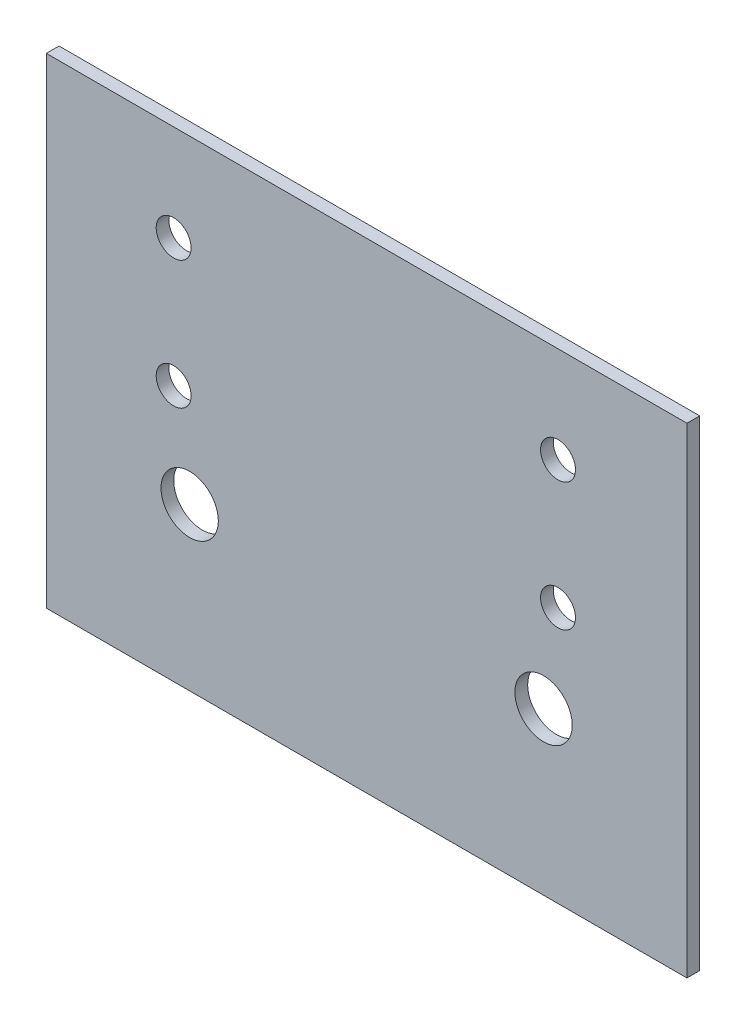
ISO-10303-21;
HEADER;
FILE_DESCRIPTION(('STEP AP214'),'2;1');
FILE_NAME('part.step','',(''),(''),'','','');
FILE_SCHEMA(('AUTOMOTIVE_DESIGN { 1 0 10303 214 1 1 1 1 }'));
ENDSEC;
DATA;
#1=APPLICATION_CONTEXT('core data for automotive mechanical design processes');
#2=APPLICATION_PROTOCOL_DEFINITION('international standard','automotive_design',2000,#1);
#3=PRODUCT_CONTEXT('',#1,'mechanical');
#4=PRODUCT('Part','Part','',(#3));
#5=PRODUCT_RELATED_PRODUCT_CATEGORY('part','',(#4));
#6=PRODUCT_DEFINITION_FORMATION('','',#4);
#7=PRODUCT_DEFINITION_CONTEXT('part definition',#1,'design');
#8=PRODUCT_DEFINITION('design','',#6,#7);
#9=PRODUCT_DEFINITION_SHAPE('','',#8);
#10=(LENGTH_UNIT() NAMED_UNIT(*) SI_UNIT(.MILLI.,.METRE.));
#11=(NAMED_UNIT(*) PLANE_ANGLE_UNIT() SI_UNIT($,.RADIAN.));
#12=(NAMED_UNIT(*) SI_UNIT($,.STERADIAN.) SOLID_ANGLE_UNIT());
#13=UNCERTAINTY_MEASURE_WITH_UNIT(LENGTH_MEASURE(1.E-05),#10,'distance_accuracy_value','');
#14=(GEOMETRIC_REPRESENTATION_CONTEXT(3) GLOBAL_UNCERTAINTY_ASSIGNED_CONTEXT((#13)) GLOBAL_UNIT_ASSIGNED_CONTEXT((#10,
#11,#12)) REPRESENTATION_CONTEXT('',''));
#15=CARTESIAN_POINT('',(0.,0.,0.));
#16=DIRECTION('',(0.,0.,1.));
#17=DIRECTION('',(1.,0.,0.));
#18=AXIS2_PLACEMENT_3D('',#15,#16,#17);
#19=CARTESIAN_POINT('',(0.,0.,8.));
#20=DIRECTION('',(0.,0.,1.));
#21=DIRECTION('',(1.,0.,0.));
#22=AXIS2_PLACEMENT_3D('',#19,#20,#21);
#23=PLANE('',#22);
#24=CARTESIAN_POINT('',(256.816671317715,-165.87972536687,8.));
#25=DIRECTION('',(0.,0.,1.));
#26=DIRECTION('',(-1.,0.,0.));
#27=AXIS2_PLACEMENT_3D('',#24,#25,#26);
#28=CIRCLE('',#27,18.);
#29=CARTESIAN_POINT('',(238.816671317715,-165.87972536687,8.));
#30=VERTEX_POINT('',#29);
#31=EDGE_CURVE('E135',#30,#30,#28,.T.);
#32=ORIENTED_EDGE('',*,*,#31,.F.);
#33=EDGE_LOOP('',(#32));
#34=FACE_BOUND('',#33,.T.);
#35=CARTESIAN_POINT('',(265.874952297419,-25.9414929111199,8.));
#36=DIRECTION('',(0.,0.,1.));
#37=DIRECTION('',(-1.,0.,0.));
#38=AXIS2_PLACEMENT_3D('',#35,#36,#37);
#39=CIRCLE('',#38,10.9608938547486);
#40=CARTESIAN_POINT('',(254.91405844267,-25.9414929111199,8.));
#41=VERTEX_POINT('',#40);
#42=EDGE_CURVE('E123',#41,#41,#39,.T.);
#43=ORIENTED_EDGE('',*,*,#42,.F.);
#44=EDGE_LOOP('',(#43));
#45=FACE_BOUND('',#44,.T.);
#46=CARTESIAN_POINT('',(24.5341701745138,-106.388420285422,8.));
#47=DIRECTION('',(0.,0.,1.));
#48=DIRECTION('',(1.,0.,0.));
#49=AXIS2_PLACEMENT_3D('',#46,#47,#48);
#50=CIRCLE('',#49,10.9608938547486);
#51=CARTESIAN_POINT('',(35.4950640292624,-106.388420285422,8.));
#52=VERTEX_POINT('',#51);
#53=EDGE_CURVE('E102',#52,#52,#50,.T.);
#54=ORIENTED_EDGE('',*,*,#53,.F.);
#55=EDGE_LOOP('',(#54));
#56=FACE_BOUND('',#55,.T.);
#57=DIRECTION('',(0.,-1.,0.));
#58=VECTOR('',#57,1.);
#59=CARTESIAN_POINT('',(-55.4139647287459,34.3937026196064,8.));
#60=LINE('',#59,#58);
#61=CARTESIAN_POINT('',(-55.4139647287459,34.3937026196064,8.));
#62=VERTEX_POINT('',#61);
#63=CARTESIAN_POINT('',(-55.4139647287459,-267.282275034025,8.));
#64=VERTEX_POINT('',#63);
#65=EDGE_CURVE('E87',#62,#64,#60,.T.);
#66=ORIENTED_EDGE('',*,*,#65,.T.);
#67=DIRECTION('',(1.,0.,0.));
#68=VECTOR('',#67,1.);
#69=CARTESIAN_POINT('',(-55.4139647287459,-267.282275034025,8.));
#70=LINE('',#69,#68);
#71=CARTESIAN_POINT('',(346.820672142762,-267.282275034025,8.));
#72=VERTEX_POINT('',#71);
#73=EDGE_CURVE('E82',#64,#72,#70,.T.);
#74=ORIENTED_EDGE('',*,*,#73,.T.);
#75=DIRECTION('',(0.,1.,0.));
#76=VECTOR('',#75,1.);
#77=CARTESIAN_POINT('',(346.820672142762,-267.282275034025,8.));
#78=LINE('',#77,#76);
#79=CARTESIAN_POINT('',(346.820672142762,34.3937026196064,8.));
#80=VERTEX_POINT('',#79);
#81=EDGE_CURVE('E85',#72,#80,#78,.T.);
#82=ORIENTED_EDGE('',*,*,#81,.T.);
#83=DIRECTION('',(-1.,0.,0.));
#84=VECTOR('',#83,1.);
#85=CARTESIAN_POINT('',(-55.4139647287459,34.3937026196064,8.));
#86=LINE('',#85,#84);
#87=EDGE_CURVE('E52',#80,#62,#86,.T.);
#88=ORIENTED_EDGE('',*,*,#87,.T.);
#89=EDGE_LOOP('',(#66,#74,#82,#88));
#90=FACE_BOUND('',#89,.T.);
#91=CARTESIAN_POINT('',(24.5341701745138,-25.9414929111199,8.));
#92=DIRECTION('',(0.,0.,1.));
#93=DIRECTION('',(1.,0.,0.));
#94=AXIS2_PLACEMENT_3D('',#91,#92,#93);
#95=CIRCLE('',#94,10.9608938547486);
#96=CARTESIAN_POINT('',(35.4950640292624,-25.9414929111199,8.));
#97=VERTEX_POINT('',#96);
#98=EDGE_CURVE('E117',#97,#97,#95,.T.);
#99=ORIENTED_EDGE('',*,*,#98,.F.);
#100=EDGE_LOOP('',(#99));
#101=FACE_BOUND('',#100,.T.);
#102=CARTESIAN_POINT('',(265.874952297419,-106.388420285422,8.));
#103=DIRECTION('',(0.,0.,1.));
#104=DIRECTION('',(1.,0.,0.));
#105=AXIS2_PLACEMENT_3D('',#102,#103,#104);
#106=CIRCLE('',#105,10.9608938547486);
#107=CARTESIAN_POINT('',(276.835846152167,-106.388420285422,8.));
#108=VERTEX_POINT('',#107);
#109=EDGE_CURVE('E129',#108,#108,#106,.T.);
#110=ORIENTED_EDGE('',*,*,#109,.F.);
#111=EDGE_LOOP('',(#110));
#112=FACE_BOUND('',#111,.T.);
#113=CARTESIAN_POINT('',(34.5900360963015,-165.87972536687,8.));
#114=DIRECTION('',(0.,0.,1.));
#115=DIRECTION('',(1.,0.,0.));
#116=AXIS2_PLACEMENT_3D('',#113,#114,#115);
#117=CIRCLE('',#116,18.);
#118=CARTESIAN_POINT('',(52.5900360963015,-165.87972536687,8.));
#119=VERTEX_POINT('',#118);
#120=EDGE_CURVE('E141',#119,#119,#117,.T.);
#121=ORIENTED_EDGE('',*,*,#120,.F.);
#122=EDGE_LOOP('',(#121));
#123=FACE_BOUND('',#122,.T.);
#124=ADVANCED_FACE('F35',(#34,#45,#56,#90,#101,#112,#123),#23,.T.);
#125=CARTESIAN_POINT('',(0.,0.,0.));
#126=DIRECTION('',(0.,0.,1.));
#127=DIRECTION('',(1.,0.,0.));
#128=AXIS2_PLACEMENT_3D('',#125,#126,#127);
#129=PLANE('',#128);
#130=DIRECTION('',(0.,-1.,0.));
#131=VECTOR('',#130,1.);
#132=CARTESIAN_POINT('',(-55.4139647287459,34.3937026196064,0.));
#133=LINE('',#132,#131);
#134=CARTESIAN_POINT('',(-55.4139647287459,34.3937026196064,0.));
#135=VERTEX_POINT('',#134);
#136=CARTESIAN_POINT('',(-55.4139647287459,-267.282275034025,0.));
#137=VERTEX_POINT('',#136);
#138=EDGE_CURVE('E99',#135,#137,#133,.T.);
#139=ORIENTED_EDGE('',*,*,#138,.F.);
#140=DIRECTION('',(-1.,0.,0.));
#141=VECTOR('',#140,1.);
#142=CARTESIAN_POINT('',(-55.4139647287459,34.3937026196064,0.));
#143=LINE('',#142,#141);
#144=CARTESIAN_POINT('',(346.820672142762,34.3937026196064,0.));
#145=VERTEX_POINT('',#144);
#146=EDGE_CURVE('E75',#145,#135,#143,.T.);
#147=ORIENTED_EDGE('',*,*,#146,.F.);
#148=DIRECTION('',(0.,1.,0.));
#149=VECTOR('',#148,1.);
#150=CARTESIAN_POINT('',(346.820672142762,-267.282275034025,0.));
#151=LINE('',#150,#149);
#152=CARTESIAN_POINT('',(346.820672142762,-267.282275034025,0.));
#153=VERTEX_POINT('',#152);
#154=EDGE_CURVE('E69',#153,#145,#151,.T.);
#155=ORIENTED_EDGE('',*,*,#154,.F.);
#156=DIRECTION('',(1.,0.,0.));
#157=VECTOR('',#156,1.);
#158=CARTESIAN_POINT('',(-55.4139647287459,-267.282275034025,0.));
#159=LINE('',#158,#157);
#160=EDGE_CURVE('E91',#137,#153,#159,.T.);
#161=ORIENTED_EDGE('',*,*,#160,.F.);
#162=EDGE_LOOP('',(#139,#147,#155,#161));
#163=FACE_BOUND('',#162,.T.);
#164=CARTESIAN_POINT('',(24.5341701745138,-106.388420285422,0.));
#165=DIRECTION('',(0.,0.,1.));
#166=DIRECTION('',(1.,0.,0.));
#167=AXIS2_PLACEMENT_3D('',#164,#165,#166);
#168=CIRCLE('',#167,10.9608938547486);
#169=CARTESIAN_POINT('',(35.4950640292624,-106.388420285422,0.));
#170=VERTEX_POINT('',#169);
#171=EDGE_CURVE('E114',#170,#170,#168,.T.);
#172=ORIENTED_EDGE('',*,*,#171,.T.);
#173=EDGE_LOOP('',(#172));
#174=FACE_BOUND('',#173,.T.);
#175=CARTESIAN_POINT('',(24.5341701745138,-25.9414929111199,0.));
#176=DIRECTION('',(0.,0.,1.));
#177=DIRECTION('',(1.,0.,0.));
#178=AXIS2_PLACEMENT_3D('',#175,#176,#177);
#179=CIRCLE('',#178,10.9608938547486);
#180=CARTESIAN_POINT('',(35.4950640292624,-25.9414929111199,0.));
#181=VERTEX_POINT('',#180);
#182=EDGE_CURVE('E120',#181,#181,#179,.T.);
#183=ORIENTED_EDGE('',*,*,#182,.T.);
#184=EDGE_LOOP('',(#183));
#185=FACE_BOUND('',#184,.T.);
#186=CARTESIAN_POINT('',(265.874952297419,-25.9414929111199,0.));
#187=DIRECTION('',(0.,0.,1.));
#188=DIRECTION('',(-1.,0.,0.));
#189=AXIS2_PLACEMENT_3D('',#186,#187,#188);
#190=CIRCLE('',#189,10.9608938547486);
#191=CARTESIAN_POINT('',(254.91405844267,-25.9414929111199,0.));
#192=VERTEX_POINT('',#191);
#193=EDGE_CURVE('E126',#192,#192,#190,.T.);
#194=ORIENTED_EDGE('',*,*,#193,.T.);
#195=EDGE_LOOP('',(#194));
#196=FACE_BOUND('',#195,.T.);
#197=CARTESIAN_POINT('',(265.874952297419,-106.388420285422,0.));
#198=DIRECTION('',(0.,0.,1.));
#199=DIRECTION('',(1.,0.,0.));
#200=AXIS2_PLACEMENT_3D('',#197,#198,#199);
#201=CIRCLE('',#200,10.9608938547486);
#202=CARTESIAN_POINT('',(276.835846152167,-106.388420285422,0.));
#203=VERTEX_POINT('',#202);
#204=EDGE_CURVE('E132',#203,#203,#201,.T.);
#205=ORIENTED_EDGE('',*,*,#204,.T.);
#206=EDGE_LOOP('',(#205));
#207=FACE_BOUND('',#206,.T.);
#208=CARTESIAN_POINT('',(256.816671317715,-165.87972536687,0.));
#209=DIRECTION('',(0.,0.,1.));
#210=DIRECTION('',(-1.,0.,0.));
#211=AXIS2_PLACEMENT_3D('',#208,#209,#210);
#212=CIRCLE('',#211,18.);
#213=CARTESIAN_POINT('',(238.816671317715,-165.87972536687,0.));
#214=VERTEX_POINT('',#213);
#215=EDGE_CURVE('E138',#214,#214,#212,.T.);
#216=ORIENTED_EDGE('',*,*,#215,.T.);
#217=EDGE_LOOP('',(#216));
#218=FACE_BOUND('',#217,.T.);
#219=CARTESIAN_POINT('',(34.5900360963015,-165.87972536687,0.));
#220=DIRECTION('',(0.,0.,1.));
#221=DIRECTION('',(1.,0.,0.));
#222=AXIS2_PLACEMENT_3D('',#219,#220,#221);
#223=CIRCLE('',#222,18.);
#224=CARTESIAN_POINT('',(52.5900360963015,-165.87972536687,0.));
#225=VERTEX_POINT('',#224);
#226=EDGE_CURVE('E144',#225,#225,#223,.T.);
#227=ORIENTED_EDGE('',*,*,#226,.T.);
#228=EDGE_LOOP('',(#227));
#229=FACE_BOUND('',#228,.T.);
#230=ADVANCED_FACE('F110',(#163,#174,#185,#196,#207,#218,#229),#129,.F.);
#231=CARTESIAN_POINT('',(-55.4139647287459,34.3937026196064,8.));
#232=DIRECTION('',(1.,0.,0.));
#233=DIRECTION('',(0.,1.,0.));
#234=AXIS2_PLACEMENT_3D('',#231,#232,#233);
#235=PLANE('',#234);
#236=ORIENTED_EDGE('',*,*,#138,.T.);
#237=DIRECTION('',(0.,0.,-1.));
#238=VECTOR('',#237,1.);
#239=CARTESIAN_POINT('',(-55.4139647287459,-267.282275034025,8.));
#240=LINE('',#239,#238);
#241=EDGE_CURVE('E11',#64,#137,#240,.T.);
#242=ORIENTED_EDGE('',*,*,#241,.F.);
#243=ORIENTED_EDGE('',*,*,#65,.F.);
#244=DIRECTION('',(0.,0.,-1.));
#245=VECTOR('',#244,1.);
#246=CARTESIAN_POINT('',(-55.4139647287459,34.3937026196064,8.));
#247=LINE('',#246,#245);
#248=EDGE_CURVE('E95',#62,#135,#247,.T.);
#249=ORIENTED_EDGE('',*,*,#248,.T.);
#250=EDGE_LOOP('',(#236,#242,#243,#249));
#251=FACE_BOUND('',#250,.T.);
#252=ADVANCED_FACE('F37',(#251),#235,.F.);
#253=CARTESIAN_POINT('',(-55.4139647287459,-267.282275034025,8.));
#254=DIRECTION('',(0.,1.,0.));
#255=DIRECTION('',(0.,0.,1.));
#256=AXIS2_PLACEMENT_3D('',#253,#254,#255);
#257=PLANE('',#256);
#258=ORIENTED_EDGE('',*,*,#160,.T.);
#259=DIRECTION('',(0.,0.,-1.));
#260=VECTOR('',#259,1.);
#261=CARTESIAN_POINT('',(346.820672142762,-267.282275034025,8.));
#262=LINE('',#261,#260);
#263=EDGE_CURVE('E44',#72,#153,#262,.T.);
#264=ORIENTED_EDGE('',*,*,#263,.F.);
#265=ORIENTED_EDGE('',*,*,#73,.F.);
#266=ORIENTED_EDGE('',*,*,#241,.T.);
#267=EDGE_LOOP('',(#258,#264,#265,#266));
#268=FACE_BOUND('',#267,.T.);
#269=ADVANCED_FACE('F90',(#268),#257,.F.);
#270=CARTESIAN_POINT('',(346.820672142762,-267.282275034025,8.));
#271=DIRECTION('',(-1.,0.,0.));
#272=DIRECTION('',(0.,0.,1.));
#273=AXIS2_PLACEMENT_3D('',#270,#271,#272);
#274=PLANE('',#273);
#275=ORIENTED_EDGE('',*,*,#154,.T.);
#276=DIRECTION('',(0.,0.,-1.));
#277=VECTOR('',#276,1.);
#278=CARTESIAN_POINT('',(346.820672142762,34.3937026196064,8.));
#279=LINE('',#278,#277);
#280=EDGE_CURVE('E92',#80,#145,#279,.T.);
#281=ORIENTED_EDGE('',*,*,#280,.F.);
#282=ORIENTED_EDGE('',*,*,#81,.F.);
#283=ORIENTED_EDGE('',*,*,#263,.T.);
#284=EDGE_LOOP('',(#275,#281,#282,#283));
#285=FACE_BOUND('',#284,.T.);
#286=ADVANCED_FACE('F93',(#285),#274,.F.);
#287=CARTESIAN_POINT('',(-55.4139647287459,34.3937026196064,8.));
#288=DIRECTION('',(0.,-1.,0.));
#289=DIRECTION('',(0.,0.,-1.));
#290=AXIS2_PLACEMENT_3D('',#287,#288,#289);
#291=PLANE('',#290);
#292=ORIENTED_EDGE('',*,*,#146,.T.);
#293=ORIENTED_EDGE('',*,*,#248,.F.);
#294=ORIENTED_EDGE('',*,*,#87,.F.);
#295=ORIENTED_EDGE('',*,*,#280,.T.);
#296=EDGE_LOOP('',(#292,#293,#294,#295));
#297=FACE_BOUND('',#296,.T.);
#298=ADVANCED_FACE('F107',(#297),#291,.F.);
#299=CARTESIAN_POINT('',(24.5341701745138,-106.388420285422,8.));
#300=DIRECTION('',(0.,0.,-1.));
#301=DIRECTION('',(-1.,0.,0.));
#302=AXIS2_PLACEMENT_3D('',#299,#300,#301);
#303=CYLINDRICAL_SURFACE('',#302,10.9608938547486);
#304=ORIENTED_EDGE('',*,*,#53,.T.);
#305=EDGE_LOOP('',(#304));
#306=FACE_BOUND('',#305,.T.);
#307=ORIENTED_EDGE('',*,*,#171,.F.);
#308=EDGE_LOOP('',(#307));
#309=FACE_BOUND('',#308,.T.);
#310=ADVANCED_FACE('F163',(#306,#309),#303,.F.);
#311=CARTESIAN_POINT('',(24.5341701745138,-25.9414929111199,8.));
#312=DIRECTION('',(0.,0.,-1.));
#313=DIRECTION('',(-1.,0.,0.));
#314=AXIS2_PLACEMENT_3D('',#311,#312,#313);
#315=CYLINDRICAL_SURFACE('',#314,10.9608938547486);
#316=ORIENTED_EDGE('',*,*,#98,.T.);
#317=EDGE_LOOP('',(#316));
#318=FACE_BOUND('',#317,.T.);
#319=ORIENTED_EDGE('',*,*,#182,.F.);
#320=EDGE_LOOP('',(#319));
#321=FACE_BOUND('',#320,.T.);
#322=ADVANCED_FACE('F209',(#318,#321),#315,.F.);
#323=CARTESIAN_POINT('',(265.874952297419,-25.9414929111199,8.));
#324=DIRECTION('',(0.,0.,-1.));
#325=DIRECTION('',(-1.,0.,0.));
#326=AXIS2_PLACEMENT_3D('',#323,#324,#325);
#327=CYLINDRICAL_SURFACE('',#326,10.9608938547486);
#328=ORIENTED_EDGE('',*,*,#42,.T.);
#329=EDGE_LOOP('',(#328));
#330=FACE_BOUND('',#329,.T.);
#331=ORIENTED_EDGE('',*,*,#193,.F.);
#332=EDGE_LOOP('',(#331));
#333=FACE_BOUND('',#332,.T.);
#334=ADVANCED_FACE('F217',(#330,#333),#327,.F.);
#335=CARTESIAN_POINT('',(265.874952297419,-106.388420285422,8.));
#336=DIRECTION('',(0.,0.,-1.));
#337=DIRECTION('',(-1.,0.,0.));
#338=AXIS2_PLACEMENT_3D('',#335,#336,#337);
#339=CYLINDRICAL_SURFACE('',#338,10.9608938547486);
#340=ORIENTED_EDGE('',*,*,#109,.T.);
#341=EDGE_LOOP('',(#340));
#342=FACE_BOUND('',#341,.T.);
#343=ORIENTED_EDGE('',*,*,#204,.F.);
#344=EDGE_LOOP('',(#343));
#345=FACE_BOUND('',#344,.T.);
#346=ADVANCED_FACE('F225',(#342,#345),#339,.F.);
#347=CARTESIAN_POINT('',(256.816671317715,-165.87972536687,8.));
#348=DIRECTION('',(0.,0.,-1.));
#349=DIRECTION('',(-1.,0.,0.));
#350=AXIS2_PLACEMENT_3D('',#347,#348,#349);
#351=CYLINDRICAL_SURFACE('',#350,18.);
#352=ORIENTED_EDGE('',*,*,#31,.T.);
#353=EDGE_LOOP('',(#352));
#354=FACE_BOUND('',#353,.T.);
#355=ORIENTED_EDGE('',*,*,#215,.F.);
#356=EDGE_LOOP('',(#355));
#357=FACE_BOUND('',#356,.T.);
#358=ADVANCED_FACE('F234',(#354,#357),#351,.F.);
#359=CARTESIAN_POINT('',(34.5900360963015,-165.87972536687,8.));
#360=DIRECTION('',(0.,0.,-1.));
#361=DIRECTION('',(-1.,0.,0.));
#362=AXIS2_PLACEMENT_3D('',#359,#360,#361);
#363=CYLINDRICAL_SURFACE('',#362,18.);
#364=ORIENTED_EDGE('',*,*,#120,.T.);
#365=EDGE_LOOP('',(#364));
#366=FACE_BOUND('',#365,.T.);
#367=ORIENTED_EDGE('',*,*,#226,.F.);
#368=EDGE_LOOP('',(#367));
#369=FACE_BOUND('',#368,.T.);
#370=ADVANCED_FACE('F150',(#366,#369),#363,.F.);
#371=CLOSED_SHELL('',(#124,#230,#252,#269,#286,#298,#310,#322,#334,#346,#358,#370));
#372=MANIFOLD_SOLID_BREP('B2',#371);
#373=ADVANCED_BREP_SHAPE_REPRESENTATION('',(#18,#372),#14);
#374=SHAPE_DEFINITION_REPRESENTATION(#9,#373);
ENDSEC;
END-ISO-10303-21;
